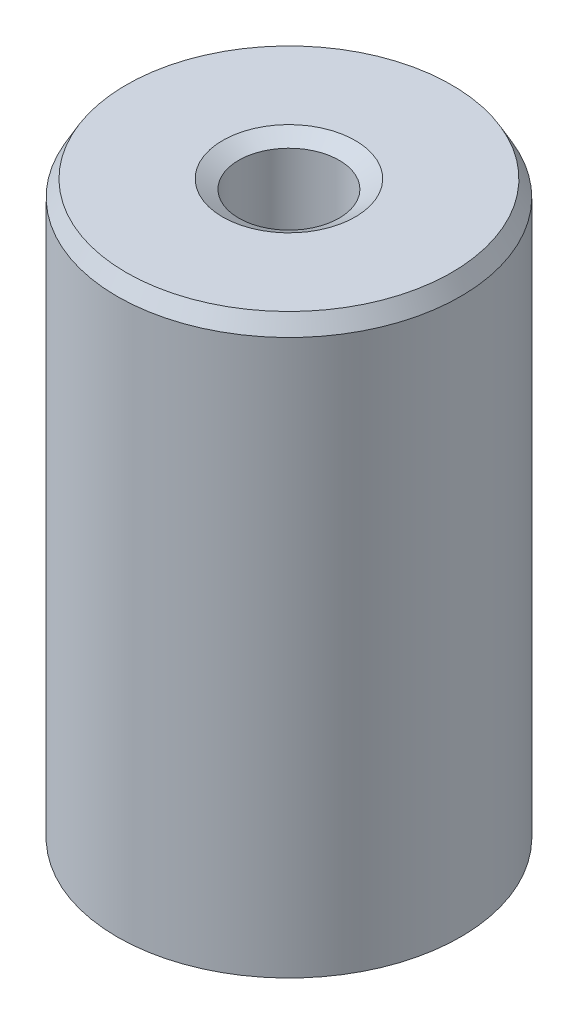
ISO-10303-21;
HEADER;
FILE_DESCRIPTION(('STEP AP214'),'2;1');
FILE_NAME('part.step','',(''),(''),'','','');
FILE_SCHEMA(('AUTOMOTIVE_DESIGN { 1 0 10303 214 1 1 1 1 }'));
ENDSEC;
DATA;
#1=APPLICATION_CONTEXT('core data for automotive mechanical design processes');
#2=APPLICATION_PROTOCOL_DEFINITION('international standard','automotive_design',2000,#1);
#3=PRODUCT_CONTEXT('',#1,'mechanical');
#4=PRODUCT('Part','Part','',(#3));
#5=PRODUCT_RELATED_PRODUCT_CATEGORY('part','',(#4));
#6=PRODUCT_DEFINITION_FORMATION('','',#4);
#7=PRODUCT_DEFINITION_CONTEXT('part definition',#1,'design');
#8=PRODUCT_DEFINITION('design','',#6,#7);
#9=PRODUCT_DEFINITION_SHAPE('','',#8);
#10=(LENGTH_UNIT() NAMED_UNIT(*) SI_UNIT(.MILLI.,.METRE.));
#11=(NAMED_UNIT(*) PLANE_ANGLE_UNIT() SI_UNIT($,.RADIAN.));
#12=(NAMED_UNIT(*) SI_UNIT($,.STERADIAN.) SOLID_ANGLE_UNIT());
#13=UNCERTAINTY_MEASURE_WITH_UNIT(LENGTH_MEASURE(1.E-05),#10,'distance_accuracy_value','');
#14=(GEOMETRIC_REPRESENTATION_CONTEXT(3) GLOBAL_UNCERTAINTY_ASSIGNED_CONTEXT((#13)) GLOBAL_UNIT_ASSIGNED_CONTEXT((#10,
#11,#12)) REPRESENTATION_CONTEXT('',''));
#15=CARTESIAN_POINT('',(0.,0.,0.));
#16=DIRECTION('',(0.,0.,1.));
#17=DIRECTION('',(1.,0.,0.));
#18=AXIS2_PLACEMENT_3D('',#15,#16,#17);
#19=CARTESIAN_POINT('',(0.,16.8873980519758,0.));
#20=DIRECTION('',(0.,-1.,0.));
#21=DIRECTION('',(0.,0.,-1.));
#22=AXIS2_PLACEMENT_3D('',#19,#20,#21);
#23=CYLINDRICAL_SURFACE('',#22,5.);
#24=CARTESIAN_POINT('',(0.,0.263978847295988,0.));
#25=DIRECTION('',(0.,1.,0.));
#26=DIRECTION('',(0.,0.,1.));
#27=AXIS2_PLACEMENT_3D('',#24,#25,#26);
#28=CIRCLE('',#27,5.);
#29=CARTESIAN_POINT('',(0.,0.263978847295988,5.));
#30=VERTEX_POINT('',#29);
#31=EDGE_CURVE('E10',#30,#30,#28,.T.);
#32=ORIENTED_EDGE('',*,*,#31,.T.);
#33=EDGE_LOOP('',(#32));
#34=FACE_BOUND('',#33,.T.);
#35=CARTESIAN_POINT('',(0.,16.4180605787747,0.));
#36=DIRECTION('',(0.,1.,0.));
#37=DIRECTION('',(0.,0.,1.));
#38=AXIS2_PLACEMENT_3D('',#35,#36,#37);
#39=CIRCLE('',#38,5.);
#40=CARTESIAN_POINT('',(0.,16.4180605787747,5.));
#41=VERTEX_POINT('',#40);
#42=EDGE_CURVE('E50',#41,#41,#39,.F.);
#43=ORIENTED_EDGE('',*,*,#42,.T.);
#44=EDGE_LOOP('',(#43));
#45=FACE_BOUND('',#44,.T.);
#46=ADVANCED_FACE('F39',(#34,#45),#23,.T.);
#47=CARTESIAN_POINT('',(0.,16.8873980519758,0.));
#48=DIRECTION('',(0.,1.,0.));
#49=DIRECTION('',(0.,0.,1.));
#50=AXIS2_PLACEMENT_3D('',#47,#48,#49);
#51=PLANE('',#50);
#52=CARTESIAN_POINT('',(0.,16.8873980519758,0.));
#53=DIRECTION('',(0.,1.,0.));
#54=DIRECTION('',(0.,0.,1.));
#55=AXIS2_PLACEMENT_3D('',#52,#53,#54);
#56=CIRCLE('',#55,1.93127579810938);
#57=CARTESIAN_POINT('',(0.,16.8873980519758,1.93127579810938));
#58=VERTEX_POINT('',#57);
#59=EDGE_CURVE('E58',#58,#58,#56,.F.);
#60=ORIENTED_EDGE('',*,*,#59,.T.);
#61=EDGE_LOOP('',(#60));
#62=FACE_BOUND('',#61,.T.);
#63=CARTESIAN_POINT('',(0.,16.8873980519758,0.));
#64=DIRECTION('',(0.,1.,0.));
#65=DIRECTION('',(0.,0.,1.));
#66=AXIS2_PLACEMENT_3D('',#63,#64,#65);
#67=CIRCLE('',#66,4.73602115270402);
#68=CARTESIAN_POINT('',(0.,16.8873980519758,4.73602115270402));
#69=VERTEX_POINT('',#68);
#70=EDGE_CURVE('E61',#69,#69,#67,.T.);
#71=ORIENTED_EDGE('',*,*,#70,.T.);
#72=EDGE_LOOP('',(#71));
#73=FACE_BOUND('',#72,.T.);
#74=ADVANCED_FACE('F88',(#62,#73),#51,.T.);
#75=CARTESIAN_POINT('',(0.,0.,0.));
#76=DIRECTION('',(0.,1.,0.));
#77=DIRECTION('',(0.,0.,1.));
#78=AXIS2_PLACEMENT_3D('',#75,#76,#77);
#79=PLANE('',#78);
#80=CARTESIAN_POINT('',(0.,0.,0.));
#81=DIRECTION('',(0.,1.,0.));
#82=DIRECTION('',(0.,0.,1.));
#83=AXIS2_PLACEMENT_3D('',#80,#81,#82);
#84=CIRCLE('',#83,1.72591717220432);
#85=CARTESIAN_POINT('',(0.,0.,1.72591717220432));
#86=VERTEX_POINT('',#85);
#87=EDGE_CURVE('E51',#86,#86,#84,.T.);
#88=ORIENTED_EDGE('',*,*,#87,.T.);
#89=EDGE_LOOP('',(#88));
#90=FACE_BOUND('',#89,.T.);
#91=CARTESIAN_POINT('',(0.,0.,0.));
#92=DIRECTION('',(0.,1.,0.));
#93=DIRECTION('',(0.,0.,1.));
#94=AXIS2_PLACEMENT_3D('',#91,#92,#93);
#95=CIRCLE('',#94,4.53066252679895);
#96=CARTESIAN_POINT('',(0.,0.,4.53066252679895));
#97=VERTEX_POINT('',#96);
#98=EDGE_CURVE('E54',#97,#97,#95,.F.);
#99=ORIENTED_EDGE('',*,*,#98,.T.);
#100=EDGE_LOOP('',(#99));
#101=FACE_BOUND('',#100,.T.);
#102=ADVANCED_FACE('F83',(#90,#101),#79,.F.);
#103=CARTESIAN_POINT('',(0.,16.8873980519758,0.));
#104=DIRECTION('',(0.,-1.,0.));
#105=DIRECTION('',(0.,0.,-1.));
#106=AXIS2_PLACEMENT_3D('',#103,#104,#105);
#107=CYLINDRICAL_SURFACE('',#106,1.46193832490834);
#108=CARTESIAN_POINT('',(0.,16.6234192046798,0.));
#109=DIRECTION('',(0.,1.,0.));
#110=DIRECTION('',(0.,0.,1.));
#111=AXIS2_PLACEMENT_3D('',#108,#109,#110);
#112=CIRCLE('',#111,1.46193832490834);
#113=CARTESIAN_POINT('',(0.,16.6234192046798,1.46193832490834));
#114=VERTEX_POINT('',#113);
#115=EDGE_CURVE('E67',#114,#114,#112,.T.);
#116=ORIENTED_EDGE('',*,*,#115,.T.);
#117=EDGE_LOOP('',(#116));
#118=FACE_BOUND('',#117,.T.);
#119=CARTESIAN_POINT('',(0.,0.469337473201051,0.));
#120=DIRECTION('',(0.,1.,0.));
#121=DIRECTION('',(0.,0.,1.));
#122=AXIS2_PLACEMENT_3D('',#119,#120,#121);
#123=CIRCLE('',#122,1.46193832490834);
#124=CARTESIAN_POINT('',(0.,0.469337473201051,1.46193832490834));
#125=VERTEX_POINT('',#124);
#126=EDGE_CURVE('E69',#125,#125,#123,.F.);
#127=ORIENTED_EDGE('',*,*,#126,.T.);
#128=EDGE_LOOP('',(#127));
#129=FACE_BOUND('',#128,.T.);
#130=ADVANCED_FACE('F71',(#118,#129),#107,.F.);
#131=CARTESIAN_POINT('',(0.,16.6234192046798,0.));
#132=DIRECTION('',(0.,1.,0.));
#133=DIRECTION('',(0.,0.,1.));
#134=AXIS2_PLACEMENT_3D('',#131,#132,#133);
#135=CONICAL_SURFACE('',#134,1.46193832490834,1.05844487297102);
#136=ORIENTED_EDGE('',*,*,#59,.F.);
#137=EDGE_LOOP('',(#136));
#138=FACE_BOUND('',#137,.T.);
#139=ORIENTED_EDGE('',*,*,#115,.F.);
#140=EDGE_LOOP('',(#139));
#141=FACE_BOUND('',#140,.T.);
#142=ADVANCED_FACE('F77',(#138,#141),#135,.F.);
#143=CARTESIAN_POINT('',(0.,0.,0.));
#144=DIRECTION('',(0.,-1.,0.));
#145=DIRECTION('',(0.,0.,-1.));
#146=AXIS2_PLACEMENT_3D('',#143,#144,#145);
#147=CONICAL_SURFACE('',#146,1.72591717220432,0.512351453823873);
#148=ORIENTED_EDGE('',*,*,#126,.F.);
#149=EDGE_LOOP('',(#148));
#150=FACE_BOUND('',#149,.T.);
#151=ORIENTED_EDGE('',*,*,#87,.F.);
#152=EDGE_LOOP('',(#151));
#153=FACE_BOUND('',#152,.T.);
#154=ADVANCED_FACE('F73',(#150,#153),#147,.F.);
#155=CARTESIAN_POINT('',(0.,0.263978847295988,0.));
#156=DIRECTION('',(0.,1.,0.));
#157=DIRECTION('',(0.,0.,1.));
#158=AXIS2_PLACEMENT_3D('',#155,#156,#157);
#159=CONICAL_SURFACE('',#158,5.,1.05844487297102);
#160=ORIENTED_EDGE('',*,*,#98,.F.);
#161=EDGE_LOOP('',(#160));
#162=FACE_BOUND('',#161,.T.);
#163=ORIENTED_EDGE('',*,*,#31,.F.);
#164=EDGE_LOOP('',(#163));
#165=FACE_BOUND('',#164,.T.);
#166=ADVANCED_FACE('F76',(#162,#165),#159,.T.);
#167=CARTESIAN_POINT('',(0.,16.8873980519758,0.));
#168=DIRECTION('',(0.,-1.,0.));
#169=DIRECTION('',(0.,0.,-1.));
#170=AXIS2_PLACEMENT_3D('',#167,#168,#169);
#171=CONICAL_SURFACE('',#170,4.73602115270402,0.512351453823875);
#172=ORIENTED_EDGE('',*,*,#42,.F.);
#173=EDGE_LOOP('',(#172));
#174=FACE_BOUND('',#173,.T.);
#175=ORIENTED_EDGE('',*,*,#70,.F.);
#176=EDGE_LOOP('',(#175));
#177=FACE_BOUND('',#176,.T.);
#178=ADVANCED_FACE('F45',(#174,#177),#171,.T.);
#179=CLOSED_SHELL('',(#46,#74,#102,#130,#142,#154,#166,#178));
#180=MANIFOLD_SOLID_BREP('B2',#179);
#181=ADVANCED_BREP_SHAPE_REPRESENTATION('',(#18,#180),#14);
#182=SHAPE_DEFINITION_REPRESENTATION(#9,#181);
ENDSEC;
END-ISO-10303-21;
